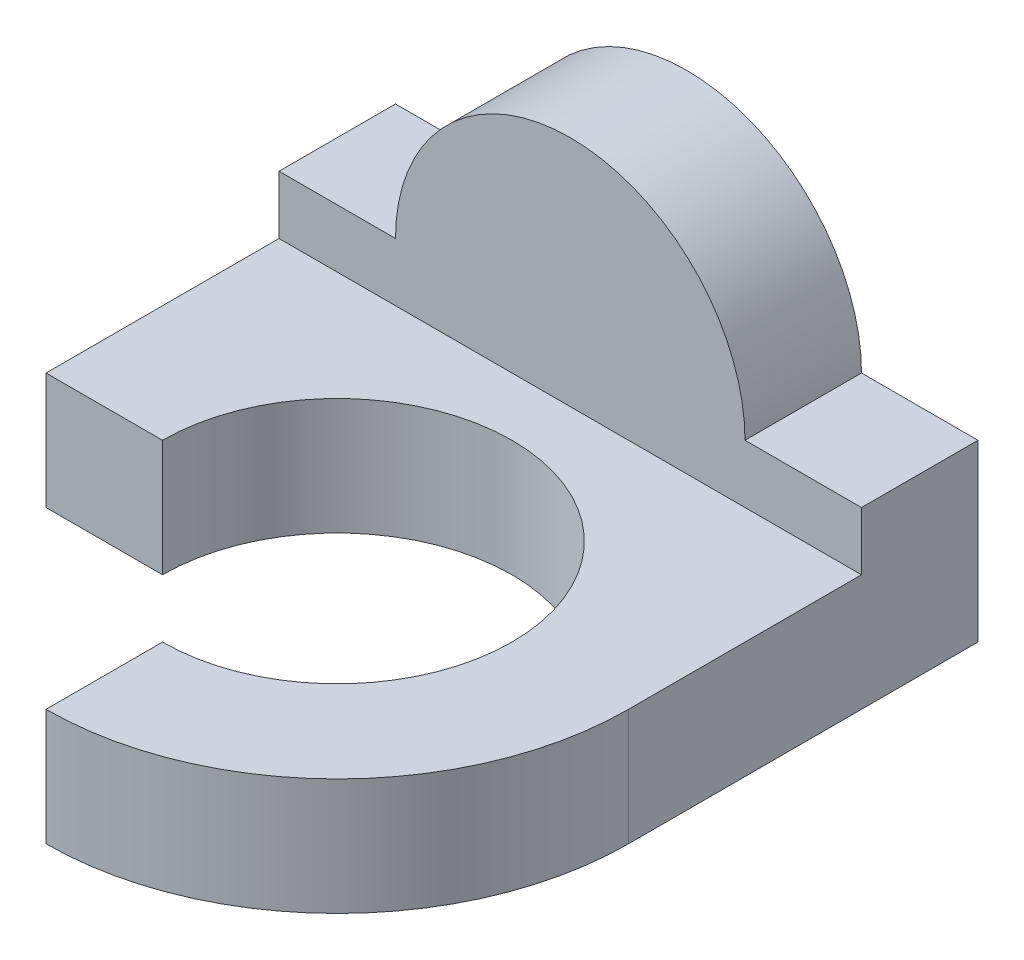
ISO-10303-21;
HEADER;
FILE_DESCRIPTION(('STEP AP214'),'2;1');
FILE_NAME('part.step','',(''),(''),'','','');
FILE_SCHEMA(('AUTOMOTIVE_DESIGN { 1 0 10303 214 1 1 1 1 }'));
ENDSEC;
DATA;
#1=APPLICATION_CONTEXT('core data for automotive mechanical design processes');
#2=APPLICATION_PROTOCOL_DEFINITION('international standard','automotive_design',2000,#1);
#3=PRODUCT_CONTEXT('',#1,'mechanical');
#4=PRODUCT('Part','Part','',(#3));
#5=PRODUCT_RELATED_PRODUCT_CATEGORY('part','',(#4));
#6=PRODUCT_DEFINITION_FORMATION('','',#4);
#7=PRODUCT_DEFINITION_CONTEXT('part definition',#1,'design');
#8=PRODUCT_DEFINITION('design','',#6,#7);
#9=PRODUCT_DEFINITION_SHAPE('','',#8);
#10=(LENGTH_UNIT() NAMED_UNIT(*) SI_UNIT(.MILLI.,.METRE.));
#11=(NAMED_UNIT(*) PLANE_ANGLE_UNIT() SI_UNIT($,.RADIAN.));
#12=(NAMED_UNIT(*) SI_UNIT($,.STERADIAN.) SOLID_ANGLE_UNIT());
#13=UNCERTAINTY_MEASURE_WITH_UNIT(LENGTH_MEASURE(1.E-05),#10,'distance_accuracy_value','');
#14=(GEOMETRIC_REPRESENTATION_CONTEXT(3) GLOBAL_UNCERTAINTY_ASSIGNED_CONTEXT((#13)) GLOBAL_UNIT_ASSIGNED_CONTEXT((#10,
#11,#12)) REPRESENTATION_CONTEXT('',''));
#15=CARTESIAN_POINT('',(0.,0.,0.));
#16=DIRECTION('',(0.,0.,1.));
#17=DIRECTION('',(1.,0.,0.));
#18=AXIS2_PLACEMENT_3D('',#15,#16,#17);
#19=CARTESIAN_POINT('',(0.,30.,110.));
#20=DIRECTION('',(0.,-1.,0.));
#21=DIRECTION('',(0.,0.,-1.));
#22=AXIS2_PLACEMENT_3D('',#19,#20,#21);
#23=PLANE('',#22);
#24=DIRECTION('',(-1.,0.,0.));
#25=VECTOR('',#24,1.);
#26=CARTESIAN_POINT('',(0.,30.,0.));
#27=LINE('',#26,#25);
#28=CARTESIAN_POINT('',(100.,30.,0.));
#29=VERTEX_POINT('',#28);
#30=CARTESIAN_POINT('',(80.,30.,0.));
#31=VERTEX_POINT('',#30);
#32=EDGE_CURVE('E190',#29,#31,#27,.T.);
#33=ORIENTED_EDGE('',*,*,#32,.T.);
#34=DIRECTION('',(0.,0.,1.));
#35=VECTOR('',#34,1.);
#36=CARTESIAN_POINT('',(80.,30.,0.));
#37=LINE('',#36,#35);
#38=CARTESIAN_POINT('',(80.,30.,20.));
#39=VERTEX_POINT('',#38);
#40=EDGE_CURVE('E157',#31,#39,#37,.T.);
#41=ORIENTED_EDGE('',*,*,#40,.T.);
#42=DIRECTION('',(-1.,0.,0.));
#43=VECTOR('',#42,1.);
#44=CARTESIAN_POINT('',(110.,30.,20.));
#45=LINE('',#44,#43);
#46=CARTESIAN_POINT('',(100.,30.,20.));
#47=VERTEX_POINT('',#46);
#48=EDGE_CURVE('E172',#47,#39,#45,.T.);
#49=ORIENTED_EDGE('',*,*,#48,.F.);
#50=DIRECTION('',(0.,0.,-1.));
#51=VECTOR('',#50,1.);
#52=CARTESIAN_POINT('',(100.,30.,110.));
#53=LINE('',#52,#51);
#54=EDGE_CURVE('E196',#47,#29,#53,.T.);
#55=ORIENTED_EDGE('',*,*,#54,.T.);
#56=EDGE_LOOP('',(#33,#41,#49,#55));
#57=FACE_BOUND('',#56,.T.);
#58=ADVANCED_FACE('F33',(#57),#23,.F.);
#59=CARTESIAN_POINT('',(0.,0.,110.));
#60=DIRECTION('',(1.,0.,0.));
#61=DIRECTION('',(0.,0.,-1.));
#62=AXIS2_PLACEMENT_3D('',#59,#60,#61);
#63=PLANE('',#62);
#64=DIRECTION('',(0.,0.,-1.));
#65=VECTOR('',#64,1.);
#66=CARTESIAN_POINT('',(0.,0.,110.));
#67=LINE('',#66,#65);
#68=CARTESIAN_POINT('',(0.,0.,60.));
#69=VERTEX_POINT('',#68);
#70=CARTESIAN_POINT('',(0.,0.,0.));
#71=VERTEX_POINT('',#70);
#72=EDGE_CURVE('E11',#69,#71,#67,.T.);
#73=ORIENTED_EDGE('',*,*,#72,.F.);
#74=DIRECTION('',(0.,1.,0.));
#75=VECTOR('',#74,1.);
#76=CARTESIAN_POINT('',(0.,0.,60.));
#77=LINE('',#76,#75);
#78=CARTESIAN_POINT('',(0.,20.,60.));
#79=VERTEX_POINT('',#78);
#80=EDGE_CURVE('E134',#69,#79,#77,.T.);
#81=ORIENTED_EDGE('',*,*,#80,.T.);
#82=DIRECTION('',(0.,0.,1.));
#83=VECTOR('',#82,1.);
#84=CARTESIAN_POINT('',(0.,20.,110.));
#85=LINE('',#84,#83);
#86=CARTESIAN_POINT('',(0.,20.,20.));
#87=VERTEX_POINT('',#86);
#88=EDGE_CURVE('E165',#87,#79,#85,.T.);
#89=ORIENTED_EDGE('',*,*,#88,.F.);
#90=DIRECTION('',(0.,-1.,0.));
#91=VECTOR('',#90,1.);
#92=CARTESIAN_POINT('',(0.,30.,20.));
#93=LINE('',#92,#91);
#94=CARTESIAN_POINT('',(0.,30.,20.));
#95=VERTEX_POINT('',#94);
#96=EDGE_CURVE('E160',#95,#87,#93,.T.);
#97=ORIENTED_EDGE('',*,*,#96,.F.);
#98=DIRECTION('',(0.,0.,-1.));
#99=VECTOR('',#98,1.);
#100=CARTESIAN_POINT('',(0.,30.,110.));
#101=LINE('',#100,#99);
#102=CARTESIAN_POINT('',(0.,30.,0.));
#103=VERTEX_POINT('',#102);
#104=EDGE_CURVE('E193',#95,#103,#101,.T.);
#105=ORIENTED_EDGE('',*,*,#104,.T.);
#106=DIRECTION('',(0.,-1.,0.));
#107=VECTOR('',#106,1.);
#108=CARTESIAN_POINT('',(0.,0.,0.));
#109=LINE('',#108,#107);
#110=EDGE_CURVE('E180',#103,#71,#109,.T.);
#111=ORIENTED_EDGE('',*,*,#110,.T.);
#112=EDGE_LOOP('',(#73,#81,#89,#97,#105,#111));
#113=FACE_BOUND('',#112,.T.);
#114=ADVANCED_FACE('F35',(#113),#63,.F.);
#115=CARTESIAN_POINT('',(0.,0.,110.));
#116=DIRECTION('',(0.,1.,0.));
#117=DIRECTION('',(0.,0.,1.));
#118=AXIS2_PLACEMENT_3D('',#115,#116,#117);
#119=PLANE('',#118);
#120=DIRECTION('',(0.,0.,-1.));
#121=VECTOR('',#120,1.);
#122=CARTESIAN_POINT('',(50.,0.,110.));
#123=LINE('',#122,#121);
#124=CARTESIAN_POINT('',(50.,0.,110.));
#125=VERTEX_POINT('',#124);
#126=CARTESIAN_POINT('',(50.,0.,90.));
#127=VERTEX_POINT('',#126);
#128=EDGE_CURVE('E130',#125,#127,#123,.T.);
#129=ORIENTED_EDGE('',*,*,#128,.T.);
#130=CARTESIAN_POINT('',(50.,0.,60.));
#131=DIRECTION('',(0.,1.,0.));
#132=DIRECTION('',(0.,0.,1.));
#133=AXIS2_PLACEMENT_3D('',#130,#131,#132);
#134=CIRCLE('',#133,30.);
#135=CARTESIAN_POINT('',(20.,0.,60.));
#136=VERTEX_POINT('',#135);
#137=EDGE_CURVE('E48',#127,#136,#134,.T.);
#138=ORIENTED_EDGE('',*,*,#137,.T.);
#139=DIRECTION('',(-1.,0.,0.));
#140=VECTOR('',#139,1.);
#141=CARTESIAN_POINT('',(0.,0.,60.));
#142=LINE('',#141,#140);
#143=EDGE_CURVE('E127',#136,#69,#142,.T.);
#144=ORIENTED_EDGE('',*,*,#143,.T.);
#145=ORIENTED_EDGE('',*,*,#72,.T.);
#146=DIRECTION('',(1.,0.,0.));
#147=VECTOR('',#146,1.);
#148=CARTESIAN_POINT('',(0.,0.,0.));
#149=LINE('',#148,#147);
#150=CARTESIAN_POINT('',(100.,0.,0.));
#151=VERTEX_POINT('',#150);
#152=EDGE_CURVE('E183',#71,#151,#149,.T.);
#153=ORIENTED_EDGE('',*,*,#152,.T.);
#154=DIRECTION('',(0.,0.,-1.));
#155=VECTOR('',#154,1.);
#156=CARTESIAN_POINT('',(100.,0.,110.));
#157=LINE('',#156,#155);
#158=CARTESIAN_POINT('',(100.,0.,60.));
#159=VERTEX_POINT('',#158);
#160=EDGE_CURVE('E41',#159,#151,#157,.T.);
#161=ORIENTED_EDGE('',*,*,#160,.F.);
#162=CARTESIAN_POINT('',(50.,0.,60.));
#163=DIRECTION('',(0.,-1.,0.));
#164=DIRECTION('',(0.,0.,-1.));
#165=AXIS2_PLACEMENT_3D('',#162,#163,#164);
#166=CIRCLE('',#165,50.);
#167=EDGE_CURVE('E146',#159,#125,#166,.T.);
#168=ORIENTED_EDGE('',*,*,#167,.T.);
#169=EDGE_LOOP('',(#129,#138,#144,#145,#153,#161,#168));
#170=FACE_BOUND('',#169,.T.);
#171=ADVANCED_FACE('F126',(#170),#119,.F.);
#172=CARTESIAN_POINT('',(100.,0.,110.));
#173=DIRECTION('',(-1.,0.,0.));
#174=DIRECTION('',(0.,0.,1.));
#175=AXIS2_PLACEMENT_3D('',#172,#173,#174);
#176=PLANE('',#175);
#177=DIRECTION('',(0.,0.,1.));
#178=VECTOR('',#177,1.);
#179=CARTESIAN_POINT('',(100.,20.,110.));
#180=LINE('',#179,#178);
#181=CARTESIAN_POINT('',(100.,20.,20.));
#182=VERTEX_POINT('',#181);
#183=CARTESIAN_POINT('',(100.,20.,60.));
#184=VERTEX_POINT('',#183);
#185=EDGE_CURVE('E171',#182,#184,#180,.T.);
#186=ORIENTED_EDGE('',*,*,#185,.T.);
#187=DIRECTION('',(0.,1.,0.));
#188=VECTOR('',#187,1.);
#189=CARTESIAN_POINT('',(100.,0.,60.));
#190=LINE('',#189,#188);
#191=EDGE_CURVE('E56',#159,#184,#190,.T.);
#192=ORIENTED_EDGE('',*,*,#191,.F.);
#193=ORIENTED_EDGE('',*,*,#160,.T.);
#194=DIRECTION('',(0.,1.,0.));
#195=VECTOR('',#194,1.);
#196=CARTESIAN_POINT('',(100.,0.,0.));
#197=LINE('',#196,#195);
#198=EDGE_CURVE('E186',#151,#29,#197,.T.);
#199=ORIENTED_EDGE('',*,*,#198,.T.);
#200=ORIENTED_EDGE('',*,*,#54,.F.);
#201=DIRECTION('',(0.,-1.,0.));
#202=VECTOR('',#201,1.);
#203=CARTESIAN_POINT('',(100.,0.,20.));
#204=LINE('',#203,#202);
#205=EDGE_CURVE('E177',#47,#182,#204,.T.);
#206=ORIENTED_EDGE('',*,*,#205,.T.);
#207=EDGE_LOOP('',(#186,#192,#193,#199,#200,#206));
#208=FACE_BOUND('',#207,.T.);
#209=ADVANCED_FACE('F199',(#208),#176,.F.);
#210=CARTESIAN_POINT('',(20.,30.,20.));
#211=VERTEX_POINT('',#210);
#212=EDGE_CURVE('E168',#211,#95,#45,.T.);
#213=ORIENTED_EDGE('',*,*,#212,.F.);
#214=DIRECTION('',(0.,0.,1.));
#215=VECTOR('',#214,1.);
#216=CARTESIAN_POINT('',(20.,30.,0.));
#217=LINE('',#216,#215);
#218=CARTESIAN_POINT('',(20.,30.,0.));
#219=VERTEX_POINT('',#218);
#220=EDGE_CURVE('E155',#219,#211,#217,.T.);
#221=ORIENTED_EDGE('',*,*,#220,.F.);
#222=EDGE_CURVE('E189',#219,#103,#27,.T.);
#223=ORIENTED_EDGE('',*,*,#222,.T.);
#224=ORIENTED_EDGE('',*,*,#104,.F.);
#225=EDGE_LOOP('',(#213,#221,#223,#224));
#226=FACE_BOUND('',#225,.T.);
#227=ADVANCED_FACE('F229',(#226),#23,.F.);
#228=CARTESIAN_POINT('',(0.,0.,0.));
#229=DIRECTION('',(0.,0.,-1.));
#230=DIRECTION('',(-1.,0.,0.));
#231=AXIS2_PLACEMENT_3D('',#228,#229,#230);
#232=PLANE('',#231);
#233=ORIENTED_EDGE('',*,*,#110,.F.);
#234=ORIENTED_EDGE('',*,*,#222,.F.);
#235=CARTESIAN_POINT('',(50.,30.,0.));
#236=DIRECTION('',(0.,0.,1.));
#237=DIRECTION('',(-1.,0.,0.));
#238=AXIS2_PLACEMENT_3D('',#235,#236,#237);
#239=CIRCLE('',#238,30.);
#240=EDGE_CURVE('E153',#31,#219,#239,.T.);
#241=ORIENTED_EDGE('',*,*,#240,.F.);
#242=ORIENTED_EDGE('',*,*,#32,.F.);
#243=ORIENTED_EDGE('',*,*,#198,.F.);
#244=ORIENTED_EDGE('',*,*,#152,.F.);
#245=EDGE_LOOP('',(#233,#234,#241,#242,#243,#244));
#246=FACE_BOUND('',#245,.T.);
#247=ADVANCED_FACE('F206',(#246),#232,.T.);
#248=CARTESIAN_POINT('',(110.,30.,20.));
#249=DIRECTION('',(0.,0.,-1.));
#250=DIRECTION('',(0.,1.,0.));
#251=AXIS2_PLACEMENT_3D('',#248,#249,#250);
#252=PLANE('',#251);
#253=ORIENTED_EDGE('',*,*,#48,.T.);
#254=CARTESIAN_POINT('',(50.,30.,20.));
#255=DIRECTION('',(0.,0.,1.));
#256=DIRECTION('',(-1.,0.,0.));
#257=AXIS2_PLACEMENT_3D('',#254,#255,#256);
#258=CIRCLE('',#257,30.);
#259=EDGE_CURVE('E151',#39,#211,#258,.T.);
#260=ORIENTED_EDGE('',*,*,#259,.T.);
#261=ORIENTED_EDGE('',*,*,#212,.T.);
#262=ORIENTED_EDGE('',*,*,#96,.T.);
#263=DIRECTION('',(-1.,0.,0.));
#264=VECTOR('',#263,1.);
#265=CARTESIAN_POINT('',(110.,20.,20.));
#266=LINE('',#265,#264);
#267=EDGE_CURVE('E169',#182,#87,#266,.T.);
#268=ORIENTED_EDGE('',*,*,#267,.F.);
#269=ORIENTED_EDGE('',*,*,#205,.F.);
#270=EDGE_LOOP('',(#253,#260,#261,#262,#268,#269));
#271=FACE_BOUND('',#270,.T.);
#272=ADVANCED_FACE('F213',(#271),#252,.F.);
#273=CARTESIAN_POINT('',(110.,20.,110.));
#274=DIRECTION('',(0.,-1.,0.));
#275=DIRECTION('',(0.,0.,-1.));
#276=AXIS2_PLACEMENT_3D('',#273,#274,#275);
#277=PLANE('',#276);
#278=DIRECTION('',(-1.,0.,0.));
#279=VECTOR('',#278,1.);
#280=CARTESIAN_POINT('',(0.,20.,60.));
#281=LINE('',#280,#279);
#282=CARTESIAN_POINT('',(20.,20.,60.));
#283=VERTEX_POINT('',#282);
#284=EDGE_CURVE('E139',#283,#79,#281,.T.);
#285=ORIENTED_EDGE('',*,*,#284,.F.);
#286=CARTESIAN_POINT('',(50.,20.,60.));
#287=DIRECTION('',(0.,1.,0.));
#288=DIRECTION('',(0.,0.,1.));
#289=AXIS2_PLACEMENT_3D('',#286,#287,#288);
#290=CIRCLE('',#289,30.);
#291=CARTESIAN_POINT('',(50.,20.,90.));
#292=VERTEX_POINT('',#291);
#293=EDGE_CURVE('E117',#292,#283,#290,.T.);
#294=ORIENTED_EDGE('',*,*,#293,.F.);
#295=DIRECTION('',(0.,0.,-1.));
#296=VECTOR('',#295,1.);
#297=CARTESIAN_POINT('',(50.,20.,110.));
#298=LINE('',#297,#296);
#299=CARTESIAN_POINT('',(50.,20.,110.));
#300=VERTEX_POINT('',#299);
#301=EDGE_CURVE('E121',#300,#292,#298,.T.);
#302=ORIENTED_EDGE('',*,*,#301,.F.);
#303=CARTESIAN_POINT('',(50.,20.,60.));
#304=DIRECTION('',(0.,-1.,0.));
#305=DIRECTION('',(0.,0.,-1.));
#306=AXIS2_PLACEMENT_3D('',#303,#304,#305);
#307=CIRCLE('',#306,50.);
#308=EDGE_CURVE('E137',#184,#300,#307,.T.);
#309=ORIENTED_EDGE('',*,*,#308,.F.);
#310=ORIENTED_EDGE('',*,*,#185,.F.);
#311=ORIENTED_EDGE('',*,*,#267,.T.);
#312=ORIENTED_EDGE('',*,*,#88,.T.);
#313=EDGE_LOOP('',(#285,#294,#302,#309,#310,#311,#312));
#314=FACE_BOUND('',#313,.T.);
#315=ADVANCED_FACE('F217',(#314),#277,.F.);
#316=CARTESIAN_POINT('',(50.,30.,0.));
#317=DIRECTION('',(0.,0.,1.));
#318=DIRECTION('',(1.,0.,0.));
#319=AXIS2_PLACEMENT_3D('',#316,#317,#318);
#320=CYLINDRICAL_SURFACE('',#319,30.);
#321=ORIENTED_EDGE('',*,*,#259,.F.);
#322=ORIENTED_EDGE('',*,*,#40,.F.);
#323=ORIENTED_EDGE('',*,*,#240,.T.);
#324=ORIENTED_EDGE('',*,*,#220,.T.);
#325=EDGE_LOOP('',(#321,#322,#323,#324));
#326=FACE_BOUND('',#325,.T.);
#327=ADVANCED_FACE('F231',(#326),#320,.T.);
#328=CARTESIAN_POINT('',(50.,0.,60.));
#329=DIRECTION('',(0.,1.,0.));
#330=DIRECTION('',(0.,0.,1.));
#331=AXIS2_PLACEMENT_3D('',#328,#329,#330);
#332=CYLINDRICAL_SURFACE('',#331,50.);
#333=ORIENTED_EDGE('',*,*,#308,.T.);
#334=DIRECTION('',(0.,1.,0.));
#335=VECTOR('',#334,1.);
#336=CARTESIAN_POINT('',(50.,0.,110.));
#337=LINE('',#336,#335);
#338=EDGE_CURVE('E148',#125,#300,#337,.T.);
#339=ORIENTED_EDGE('',*,*,#338,.F.);
#340=ORIENTED_EDGE('',*,*,#167,.F.);
#341=ORIENTED_EDGE('',*,*,#191,.T.);
#342=EDGE_LOOP('',(#333,#339,#340,#341));
#343=FACE_BOUND('',#342,.T.);
#344=ADVANCED_FACE('F220',(#343),#332,.T.);
#345=CARTESIAN_POINT('',(0.,0.,60.));
#346=DIRECTION('',(0.,0.,-1.));
#347=DIRECTION('',(0.,1.,0.));
#348=AXIS2_PLACEMENT_3D('',#345,#346,#347);
#349=PLANE('',#348);
#350=ORIENTED_EDGE('',*,*,#143,.F.);
#351=DIRECTION('',(0.,1.,0.));
#352=VECTOR('',#351,1.);
#353=CARTESIAN_POINT('',(20.,0.,60.));
#354=LINE('',#353,#352);
#355=EDGE_CURVE('E114',#136,#283,#354,.T.);
#356=ORIENTED_EDGE('',*,*,#355,.T.);
#357=ORIENTED_EDGE('',*,*,#284,.T.);
#358=ORIENTED_EDGE('',*,*,#80,.F.);
#359=EDGE_LOOP('',(#350,#356,#357,#358));
#360=FACE_BOUND('',#359,.T.);
#361=ADVANCED_FACE('F132',(#360),#349,.F.);
#362=CARTESIAN_POINT('',(50.,0.,110.));
#363=DIRECTION('',(1.,0.,0.));
#364=DIRECTION('',(0.,0.,-1.));
#365=AXIS2_PLACEMENT_3D('',#362,#363,#364);
#366=PLANE('',#365);
#367=ORIENTED_EDGE('',*,*,#301,.T.);
#368=DIRECTION('',(0.,1.,0.));
#369=VECTOR('',#368,1.);
#370=CARTESIAN_POINT('',(50.,0.,90.));
#371=LINE('',#370,#369);
#372=EDGE_CURVE('E122',#127,#292,#371,.T.);
#373=ORIENTED_EDGE('',*,*,#372,.F.);
#374=ORIENTED_EDGE('',*,*,#128,.F.);
#375=ORIENTED_EDGE('',*,*,#338,.T.);
#376=EDGE_LOOP('',(#367,#373,#374,#375));
#377=FACE_BOUND('',#376,.T.);
#378=ADVANCED_FACE('F222',(#377),#366,.F.);
#379=CARTESIAN_POINT('',(50.,0.,60.));
#380=DIRECTION('',(0.,1.,0.));
#381=DIRECTION('',(0.,0.,1.));
#382=AXIS2_PLACEMENT_3D('',#379,#380,#381);
#383=CYLINDRICAL_SURFACE('',#382,30.);
#384=ORIENTED_EDGE('',*,*,#293,.T.);
#385=ORIENTED_EDGE('',*,*,#355,.F.);
#386=ORIENTED_EDGE('',*,*,#137,.F.);
#387=ORIENTED_EDGE('',*,*,#372,.T.);
#388=EDGE_LOOP('',(#384,#385,#386,#387));
#389=FACE_BOUND('',#388,.T.);
#390=ADVANCED_FACE('F115',(#389),#383,.F.);
#391=CLOSED_SHELL('',(#58,#114,#171,#209,#227,#247,#272,#315,#327,#344,#361,#378,#390));
#392=MANIFOLD_SOLID_BREP('B2',#391);
#393=ADVANCED_BREP_SHAPE_REPRESENTATION('',(#18,#392),#14);
#394=SHAPE_DEFINITION_REPRESENTATION(#9,#393);
ENDSEC;
END-ISO-10303-21;
